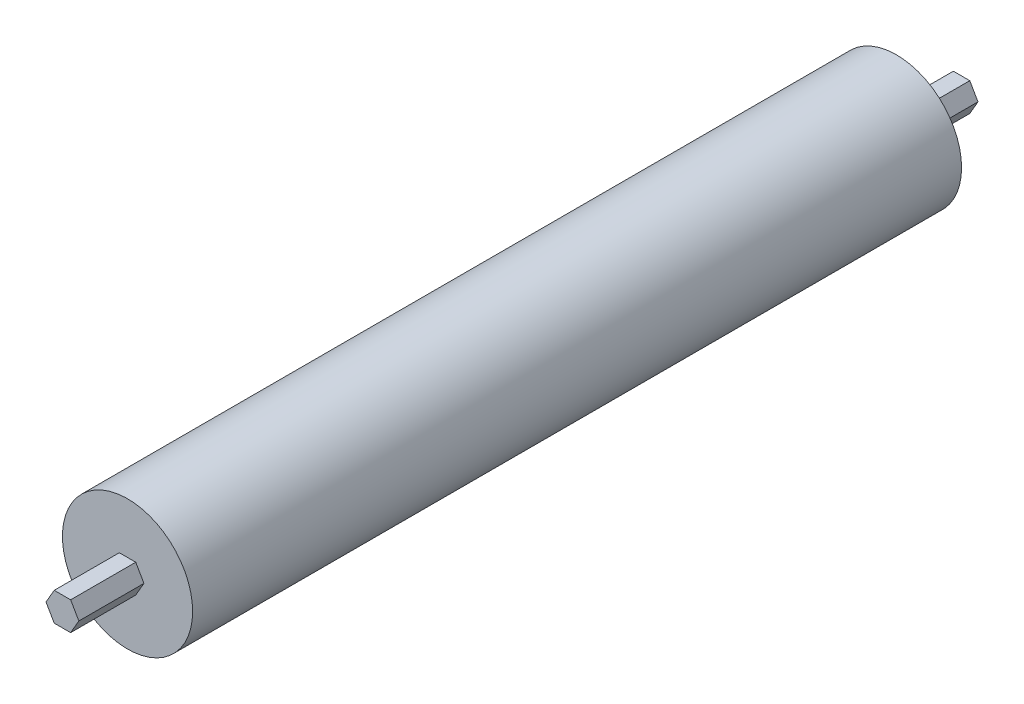
ISO-10303-21;
HEADER;
FILE_DESCRIPTION(('STEP AP214'),'2;1');
FILE_NAME('part.step','',(''),(''),'','','');
FILE_SCHEMA(('AUTOMOTIVE_DESIGN { 1 0 10303 214 1 1 1 1 }'));
ENDSEC;
DATA;
#1=APPLICATION_CONTEXT('core data for automotive mechanical design processes');
#2=APPLICATION_PROTOCOL_DEFINITION('international standard','automotive_design',2000,#1);
#3=PRODUCT_CONTEXT('',#1,'mechanical');
#4=PRODUCT('Part','Part','',(#3));
#5=PRODUCT_RELATED_PRODUCT_CATEGORY('part','',(#4));
#6=PRODUCT_DEFINITION_FORMATION('','',#4);
#7=PRODUCT_DEFINITION_CONTEXT('part definition',#1,'design');
#8=PRODUCT_DEFINITION('design','',#6,#7);
#9=PRODUCT_DEFINITION_SHAPE('','',#8);
#10=(LENGTH_UNIT() NAMED_UNIT(*) SI_UNIT(.MILLI.,.METRE.));
#11=(NAMED_UNIT(*) PLANE_ANGLE_UNIT() SI_UNIT($,.RADIAN.));
#12=(NAMED_UNIT(*) SI_UNIT($,.STERADIAN.) SOLID_ANGLE_UNIT());
#13=UNCERTAINTY_MEASURE_WITH_UNIT(LENGTH_MEASURE(1.E-05),#10,'distance_accuracy_value','');
#14=(GEOMETRIC_REPRESENTATION_CONTEXT(3) GLOBAL_UNCERTAINTY_ASSIGNED_CONTEXT((#13)) GLOBAL_UNIT_ASSIGNED_CONTEXT((#10,
#11,#12)) REPRESENTATION_CONTEXT('',''));
#15=CARTESIAN_POINT('',(0.,0.,0.));
#16=DIRECTION('',(0.,0.,1.));
#17=DIRECTION('',(1.,0.,0.));
#18=AXIS2_PLACEMENT_3D('',#15,#16,#17);
#19=CARTESIAN_POINT('',(0.,0.,0.));
#20=DIRECTION('',(0.,0.,1.));
#21=DIRECTION('',(1.,0.,0.));
#22=AXIS2_PLACEMENT_3D('',#19,#20,#21);
#23=PLANE('',#22);
#24=CARTESIAN_POINT('',(0.,0.,0.));
#25=DIRECTION('',(0.,0.,1.));
#26=DIRECTION('',(1.,0.,0.));
#27=AXIS2_PLACEMENT_3D('',#24,#25,#26);
#28=CIRCLE('',#27,25.4);
#29=CARTESIAN_POINT('',(25.4,0.,0.));
#30=VERTEX_POINT('',#29);
#31=EDGE_CURVE('E34',#30,#30,#28,.T.);
#32=ORIENTED_EDGE('',*,*,#31,.F.);
#33=EDGE_LOOP('',(#32));
#34=FACE_BOUND('',#33,.T.);
#35=DIRECTION('',(-0.5,0.866025403784439,0.));
#36=VECTOR('',#35,1.);
#37=CARTESIAN_POINT('',(-3.20429399400242,-5.55,0.));
#38=LINE('',#37,#36);
#39=CARTESIAN_POINT('',(-3.20429399400242,-5.55,0.));
#40=VERTEX_POINT('',#39);
#41=CARTESIAN_POINT('',(-6.40858798800484,0.,0.));
#42=VERTEX_POINT('',#41);
#43=EDGE_CURVE('E139',#40,#42,#38,.T.);
#44=ORIENTED_EDGE('',*,*,#43,.F.);
#45=DIRECTION('',(-1.,0.,0.));
#46=VECTOR('',#45,1.);
#47=CARTESIAN_POINT('',(3.20429399400243,-5.55,0.));
#48=LINE('',#47,#46);
#49=CARTESIAN_POINT('',(3.20429399400243,-5.55,0.));
#50=VERTEX_POINT('',#49);
#51=EDGE_CURVE('E136',#50,#40,#48,.T.);
#52=ORIENTED_EDGE('',*,*,#51,.F.);
#53=DIRECTION('',(-0.5,-0.866025403784439,0.));
#54=VECTOR('',#53,1.);
#55=CARTESIAN_POINT('',(6.40858798800485,0.,0.));
#56=LINE('',#55,#54);
#57=CARTESIAN_POINT('',(6.40858798800485,0.,0.));
#58=VERTEX_POINT('',#57);
#59=EDGE_CURVE('E204',#58,#50,#56,.T.);
#60=ORIENTED_EDGE('',*,*,#59,.F.);
#61=DIRECTION('',(0.5,-0.866025403784439,0.));
#62=VECTOR('',#61,1.);
#63=CARTESIAN_POINT('',(3.20429399400243,5.55,0.));
#64=LINE('',#63,#62);
#65=CARTESIAN_POINT('',(3.20429399400242,5.55,0.));
#66=VERTEX_POINT('',#65);
#67=EDGE_CURVE('E221',#66,#58,#64,.T.);
#68=ORIENTED_EDGE('',*,*,#67,.F.);
#69=DIRECTION('',(1.,0.,0.));
#70=VECTOR('',#69,1.);
#71=CARTESIAN_POINT('',(-3.20429399400242,5.55,0.));
#72=LINE('',#71,#70);
#73=CARTESIAN_POINT('',(-3.20429399400242,5.55,0.));
#74=VERTEX_POINT('',#73);
#75=EDGE_CURVE('E50',#74,#66,#72,.T.);
#76=ORIENTED_EDGE('',*,*,#75,.F.);
#77=DIRECTION('',(0.5,0.866025403784439,0.));
#78=VECTOR('',#77,1.);
#79=CARTESIAN_POINT('',(-6.40858798800485,0.,0.));
#80=LINE('',#79,#78);
#81=EDGE_CURVE('E45',#42,#74,#80,.T.);
#82=ORIENTED_EDGE('',*,*,#81,.F.);
#83=EDGE_LOOP('',(#44,#52,#60,#68,#76,#82));
#84=FACE_BOUND('',#83,.T.);
#85=ADVANCED_FACE('F30',(#34,#84),#23,.F.);
#86=CARTESIAN_POINT('',(0.,0.,300.));
#87=DIRECTION('',(0.,0.,1.));
#88=DIRECTION('',(1.,0.,0.));
#89=AXIS2_PLACEMENT_3D('',#86,#87,#88);
#90=PLANE('',#89);
#91=CARTESIAN_POINT('',(0.,0.,300.));
#92=DIRECTION('',(0.,0.,1.));
#93=DIRECTION('',(1.,0.,0.));
#94=AXIS2_PLACEMENT_3D('',#91,#92,#93);
#95=CIRCLE('',#94,25.4);
#96=CARTESIAN_POINT('',(25.4,0.,300.));
#97=VERTEX_POINT('',#96);
#98=EDGE_CURVE('E11',#97,#97,#95,.T.);
#99=ORIENTED_EDGE('',*,*,#98,.T.);
#100=EDGE_LOOP('',(#99));
#101=FACE_BOUND('',#100,.T.);
#102=DIRECTION('',(-0.5,0.866025403784439,0.));
#103=VECTOR('',#102,1.);
#104=CARTESIAN_POINT('',(6.40858798800484,0.,300.));
#105=LINE('',#104,#103);
#106=CARTESIAN_POINT('',(6.40858798800484,0.,300.));
#107=VERTEX_POINT('',#106);
#108=CARTESIAN_POINT('',(3.20429399400242,5.55,300.));
#109=VERTEX_POINT('',#108);
#110=EDGE_CURVE('E143',#107,#109,#105,.T.);
#111=ORIENTED_EDGE('',*,*,#110,.F.);
#112=DIRECTION('',(0.5,0.866025403784439,0.));
#113=VECTOR('',#112,1.);
#114=CARTESIAN_POINT('',(3.20429399400242,-5.55,300.));
#115=LINE('',#114,#113);
#116=CARTESIAN_POINT('',(3.20429399400242,-5.55,300.));
#117=VERTEX_POINT('',#116);
#118=EDGE_CURVE('E140',#117,#107,#115,.T.);
#119=ORIENTED_EDGE('',*,*,#118,.F.);
#120=DIRECTION('',(1.,0.,0.));
#121=VECTOR('',#120,1.);
#122=CARTESIAN_POINT('',(-3.20429399400242,-5.55,300.));
#123=LINE('',#122,#121);
#124=CARTESIAN_POINT('',(-3.20429399400242,-5.55,300.));
#125=VERTEX_POINT('',#124);
#126=EDGE_CURVE('E153',#125,#117,#123,.T.);
#127=ORIENTED_EDGE('',*,*,#126,.F.);
#128=DIRECTION('',(0.5,-0.866025403784439,0.));
#129=VECTOR('',#128,1.);
#130=CARTESIAN_POINT('',(-6.40858798800485,0.,300.));
#131=LINE('',#130,#129);
#132=CARTESIAN_POINT('',(-6.40858798800485,0.,300.));
#133=VERTEX_POINT('',#132);
#134=EDGE_CURVE('E169',#133,#125,#131,.T.);
#135=ORIENTED_EDGE('',*,*,#134,.F.);
#136=DIRECTION('',(-0.5,-0.866025403784439,0.));
#137=VECTOR('',#136,1.);
#138=CARTESIAN_POINT('',(-3.20429399400242,5.55,300.));
#139=LINE('',#138,#137);
#140=CARTESIAN_POINT('',(-3.20429399400242,5.55,300.));
#141=VERTEX_POINT('',#140);
#142=EDGE_CURVE('E167',#141,#133,#139,.T.);
#143=ORIENTED_EDGE('',*,*,#142,.F.);
#144=DIRECTION('',(-1.,0.,0.));
#145=VECTOR('',#144,1.);
#146=CARTESIAN_POINT('',(3.20429399400242,5.55,300.));
#147=LINE('',#146,#145);
#148=EDGE_CURVE('E165',#109,#141,#147,.T.);
#149=ORIENTED_EDGE('',*,*,#148,.F.);
#150=EDGE_LOOP('',(#111,#119,#127,#135,#143,#149));
#151=FACE_BOUND('',#150,.T.);
#152=ADVANCED_FACE('F194',(#101,#151),#90,.T.);
#153=CARTESIAN_POINT('',(0.,0.,300.));
#154=DIRECTION('',(0.,0.,-1.));
#155=DIRECTION('',(-1.,0.,0.));
#156=AXIS2_PLACEMENT_3D('',#153,#154,#155);
#157=CYLINDRICAL_SURFACE('',#156,25.4);
#158=ORIENTED_EDGE('',*,*,#98,.F.);
#159=EDGE_LOOP('',(#158));
#160=FACE_BOUND('',#159,.T.);
#161=ORIENTED_EDGE('',*,*,#31,.T.);
#162=EDGE_LOOP('',(#161));
#163=FACE_BOUND('',#162,.T.);
#164=ADVANCED_FACE('F32',(#160,#163),#157,.T.);
#165=CARTESIAN_POINT('',(3.20429399400242,-5.55,325.4));
#166=DIRECTION('',(-0.866025403784439,0.5,0.));
#167=DIRECTION('',(-0.5,-0.866025403784439,0.));
#168=AXIS2_PLACEMENT_3D('',#165,#166,#167);
#169=PLANE('',#168);
#170=ORIENTED_EDGE('',*,*,#118,.T.);
#171=DIRECTION('',(0.,0.,-1.));
#172=VECTOR('',#171,1.);
#173=CARTESIAN_POINT('',(6.40858798800484,0.,325.4));
#174=LINE('',#173,#172);
#175=CARTESIAN_POINT('',(6.40858798800484,0.,325.4));
#176=VERTEX_POINT('',#175);
#177=EDGE_CURVE('E186',#176,#107,#174,.T.);
#178=ORIENTED_EDGE('',*,*,#177,.F.);
#179=DIRECTION('',(0.5,0.866025403784439,0.));
#180=VECTOR('',#179,1.);
#181=CARTESIAN_POINT('',(3.20429399400242,-5.55,325.4));
#182=LINE('',#181,#180);
#183=CARTESIAN_POINT('',(3.20429399400242,-5.55,325.4));
#184=VERTEX_POINT('',#183);
#185=EDGE_CURVE('E149',#184,#176,#182,.T.);
#186=ORIENTED_EDGE('',*,*,#185,.F.);
#187=DIRECTION('',(0.,0.,-1.));
#188=VECTOR('',#187,1.);
#189=CARTESIAN_POINT('',(3.20429399400242,-5.55,325.4));
#190=LINE('',#189,#188);
#191=EDGE_CURVE('E162',#184,#117,#190,.T.);
#192=ORIENTED_EDGE('',*,*,#191,.T.);
#193=EDGE_LOOP('',(#170,#178,#186,#192));
#194=FACE_BOUND('',#193,.T.);
#195=ADVANCED_FACE('F273',(#194),#169,.F.);
#196=CARTESIAN_POINT('',(6.40858798800484,0.,325.4));
#197=DIRECTION('',(-0.866025403784439,-0.5,0.));
#198=DIRECTION('',(0.5,-0.866025403784439,0.));
#199=AXIS2_PLACEMENT_3D('',#196,#197,#198);
#200=PLANE('',#199);
#201=ORIENTED_EDGE('',*,*,#110,.T.);
#202=DIRECTION('',(0.,0.,-1.));
#203=VECTOR('',#202,1.);
#204=CARTESIAN_POINT('',(3.20429399400242,5.55,325.4));
#205=LINE('',#204,#203);
#206=CARTESIAN_POINT('',(3.20429399400242,5.55,325.4));
#207=VERTEX_POINT('',#206);
#208=EDGE_CURVE('E183',#207,#109,#205,.T.);
#209=ORIENTED_EDGE('',*,*,#208,.F.);
#210=DIRECTION('',(-0.5,0.866025403784439,0.));
#211=VECTOR('',#210,1.);
#212=CARTESIAN_POINT('',(6.40858798800484,0.,325.4));
#213=LINE('',#212,#211);
#214=EDGE_CURVE('E152',#176,#207,#213,.T.);
#215=ORIENTED_EDGE('',*,*,#214,.F.);
#216=ORIENTED_EDGE('',*,*,#177,.T.);
#217=EDGE_LOOP('',(#201,#209,#215,#216));
#218=FACE_BOUND('',#217,.T.);
#219=ADVANCED_FACE('F269',(#218),#200,.F.);
#220=CARTESIAN_POINT('',(3.20429399400242,5.55,325.4));
#221=DIRECTION('',(0.,-1.,0.));
#222=DIRECTION('',(0.,0.,-1.));
#223=AXIS2_PLACEMENT_3D('',#220,#221,#222);
#224=PLANE('',#223);
#225=ORIENTED_EDGE('',*,*,#148,.T.);
#226=DIRECTION('',(0.,0.,-1.));
#227=VECTOR('',#226,1.);
#228=CARTESIAN_POINT('',(-3.20429399400242,5.55,325.4));
#229=LINE('',#228,#227);
#230=CARTESIAN_POINT('',(-3.20429399400242,5.55,325.4));
#231=VERTEX_POINT('',#230);
#232=EDGE_CURVE('E180',#231,#141,#229,.T.);
#233=ORIENTED_EDGE('',*,*,#232,.F.);
#234=DIRECTION('',(-1.,0.,0.));
#235=VECTOR('',#234,1.);
#236=CARTESIAN_POINT('',(3.20429399400242,5.55,325.4));
#237=LINE('',#236,#235);
#238=EDGE_CURVE('E155',#207,#231,#237,.T.);
#239=ORIENTED_EDGE('',*,*,#238,.F.);
#240=ORIENTED_EDGE('',*,*,#208,.T.);
#241=EDGE_LOOP('',(#225,#233,#239,#240));
#242=FACE_BOUND('',#241,.T.);
#243=ADVANCED_FACE('F265',(#242),#224,.F.);
#244=CARTESIAN_POINT('',(-3.20429399400242,5.55,325.4));
#245=DIRECTION('',(0.866025403784439,-0.5,0.));
#246=DIRECTION('',(0.5,0.866025403784439,0.));
#247=AXIS2_PLACEMENT_3D('',#244,#245,#246);
#248=PLANE('',#247);
#249=ORIENTED_EDGE('',*,*,#142,.T.);
#250=DIRECTION('',(0.,0.,-1.));
#251=VECTOR('',#250,1.);
#252=CARTESIAN_POINT('',(-6.40858798800485,0.,325.4));
#253=LINE('',#252,#251);
#254=CARTESIAN_POINT('',(-6.40858798800485,0.,325.4));
#255=VERTEX_POINT('',#254);
#256=EDGE_CURVE('E177',#255,#133,#253,.T.);
#257=ORIENTED_EDGE('',*,*,#256,.F.);
#258=DIRECTION('',(-0.5,-0.866025403784439,0.));
#259=VECTOR('',#258,1.);
#260=CARTESIAN_POINT('',(-3.20429399400242,5.55,325.4));
#261=LINE('',#260,#259);
#262=EDGE_CURVE('E157',#231,#255,#261,.T.);
#263=ORIENTED_EDGE('',*,*,#262,.F.);
#264=ORIENTED_EDGE('',*,*,#232,.T.);
#265=EDGE_LOOP('',(#249,#257,#263,#264));
#266=FACE_BOUND('',#265,.T.);
#267=ADVANCED_FACE('F261',(#266),#248,.F.);
#268=CARTESIAN_POINT('',(-6.40858798800485,0.,325.4));
#269=DIRECTION('',(0.866025403784439,0.5,0.));
#270=DIRECTION('',(-0.5,0.866025403784439,0.));
#271=AXIS2_PLACEMENT_3D('',#268,#269,#270);
#272=PLANE('',#271);
#273=ORIENTED_EDGE('',*,*,#134,.T.);
#274=DIRECTION('',(0.,0.,-1.));
#275=VECTOR('',#274,1.);
#276=CARTESIAN_POINT('',(-3.20429399400242,-5.55,325.4));
#277=LINE('',#276,#275);
#278=CARTESIAN_POINT('',(-3.20429399400242,-5.55,325.4));
#279=VERTEX_POINT('',#278);
#280=EDGE_CURVE('E175',#279,#125,#277,.T.);
#281=ORIENTED_EDGE('',*,*,#280,.F.);
#282=DIRECTION('',(0.5,-0.866025403784439,0.));
#283=VECTOR('',#282,1.);
#284=CARTESIAN_POINT('',(-6.40858798800485,0.,325.4));
#285=LINE('',#284,#283);
#286=EDGE_CURVE('E159',#255,#279,#285,.T.);
#287=ORIENTED_EDGE('',*,*,#286,.F.);
#288=ORIENTED_EDGE('',*,*,#256,.T.);
#289=EDGE_LOOP('',(#273,#281,#287,#288));
#290=FACE_BOUND('',#289,.T.);
#291=ADVANCED_FACE('F257',(#290),#272,.F.);
#292=CARTESIAN_POINT('',(-3.20429399400242,-5.55,325.4));
#293=DIRECTION('',(0.,1.,0.));
#294=DIRECTION('',(-1.,0.,0.));
#295=AXIS2_PLACEMENT_3D('',#292,#293,#294);
#296=PLANE('',#295);
#297=ORIENTED_EDGE('',*,*,#126,.T.);
#298=ORIENTED_EDGE('',*,*,#191,.F.);
#299=DIRECTION('',(1.,0.,0.));
#300=VECTOR('',#299,1.);
#301=CARTESIAN_POINT('',(-3.20429399400242,-5.55,325.4));
#302=LINE('',#301,#300);
#303=EDGE_CURVE('E161',#279,#184,#302,.T.);
#304=ORIENTED_EDGE('',*,*,#303,.F.);
#305=ORIENTED_EDGE('',*,*,#280,.T.);
#306=EDGE_LOOP('',(#297,#298,#304,#305));
#307=FACE_BOUND('',#306,.T.);
#308=ADVANCED_FACE('F253',(#307),#296,.F.);
#309=CARTESIAN_POINT('',(6.40858798800484,0.,325.4));
#310=DIRECTION('',(0.,0.,1.));
#311=DIRECTION('',(1.,0.,0.));
#312=AXIS2_PLACEMENT_3D('',#309,#310,#311);
#313=PLANE('',#312);
#314=ORIENTED_EDGE('',*,*,#185,.T.);
#315=ORIENTED_EDGE('',*,*,#214,.T.);
#316=ORIENTED_EDGE('',*,*,#238,.T.);
#317=ORIENTED_EDGE('',*,*,#262,.T.);
#318=ORIENTED_EDGE('',*,*,#286,.T.);
#319=ORIENTED_EDGE('',*,*,#303,.T.);
#320=EDGE_LOOP('',(#314,#315,#316,#317,#318,#319));
#321=FACE_BOUND('',#320,.T.);
#322=ADVANCED_FACE('F250',(#321),#313,.T.);
#323=CARTESIAN_POINT('',(-3.20429399400242,-5.55,-25.4));
#324=DIRECTION('',(0.866025403784439,0.5,0.));
#325=DIRECTION('',(-0.5,0.866025403784439,0.));
#326=AXIS2_PLACEMENT_3D('',#323,#324,#325);
#327=PLANE('',#326);
#328=ORIENTED_EDGE('',*,*,#43,.T.);
#329=DIRECTION('',(0.,0.,1.));
#330=VECTOR('',#329,1.);
#331=CARTESIAN_POINT('',(-6.40858798800485,0.,-25.4));
#332=LINE('',#331,#330);
#333=CARTESIAN_POINT('',(-6.40858798800485,0.,-25.4));
#334=VERTEX_POINT('',#333);
#335=EDGE_CURVE('E120',#334,#42,#332,.T.);
#336=ORIENTED_EDGE('',*,*,#335,.F.);
#337=DIRECTION('',(-0.5,0.866025403784439,0.));
#338=VECTOR('',#337,1.);
#339=CARTESIAN_POINT('',(-3.20429399400242,-5.55,-25.4));
#340=LINE('',#339,#338);
#341=CARTESIAN_POINT('',(-3.20429399400242,-5.55,-25.4));
#342=VERTEX_POINT('',#341);
#343=EDGE_CURVE('E127',#342,#334,#340,.T.);
#344=ORIENTED_EDGE('',*,*,#343,.F.);
#345=DIRECTION('',(0.,0.,1.));
#346=VECTOR('',#345,1.);
#347=CARTESIAN_POINT('',(-3.20429399400242,-5.55,-25.4));
#348=LINE('',#347,#346);
#349=EDGE_CURVE('E201',#342,#40,#348,.T.);
#350=ORIENTED_EDGE('',*,*,#349,.T.);
#351=EDGE_LOOP('',(#328,#336,#344,#350));
#352=FACE_BOUND('',#351,.T.);
#353=ADVANCED_FACE('F138',(#352),#327,.F.);
#354=CARTESIAN_POINT('',(-6.40858798800485,0.,-25.4));
#355=DIRECTION('',(0.866025403784439,-0.5,0.));
#356=DIRECTION('',(0.5,0.866025403784439,0.));
#357=AXIS2_PLACEMENT_3D('',#354,#355,#356);
#358=PLANE('',#357);
#359=ORIENTED_EDGE('',*,*,#81,.T.);
#360=DIRECTION('',(0.,0.,1.));
#361=VECTOR('',#360,1.);
#362=CARTESIAN_POINT('',(-3.20429399400242,5.55,-25.4));
#363=LINE('',#362,#361);
#364=CARTESIAN_POINT('',(-3.20429399400242,5.55,-25.4));
#365=VERTEX_POINT('',#364);
#366=EDGE_CURVE('E123',#365,#74,#363,.T.);
#367=ORIENTED_EDGE('',*,*,#366,.F.);
#368=DIRECTION('',(0.5,0.866025403784439,0.));
#369=VECTOR('',#368,1.);
#370=CARTESIAN_POINT('',(-6.40858798800485,0.,-25.4));
#371=LINE('',#370,#369);
#372=EDGE_CURVE('E116',#334,#365,#371,.T.);
#373=ORIENTED_EDGE('',*,*,#372,.F.);
#374=ORIENTED_EDGE('',*,*,#335,.T.);
#375=EDGE_LOOP('',(#359,#367,#373,#374));
#376=FACE_BOUND('',#375,.T.);
#377=ADVANCED_FACE('F118',(#376),#358,.F.);
#378=CARTESIAN_POINT('',(-3.20429399400242,5.55,-25.4));
#379=DIRECTION('',(0.,-1.,0.));
#380=DIRECTION('',(0.,0.,-1.));
#381=AXIS2_PLACEMENT_3D('',#378,#379,#380);
#382=PLANE('',#381);
#383=ORIENTED_EDGE('',*,*,#75,.T.);
#384=DIRECTION('',(0.,0.,1.));
#385=VECTOR('',#384,1.);
#386=CARTESIAN_POINT('',(3.20429399400243,5.55,-25.4));
#387=LINE('',#386,#385);
#388=CARTESIAN_POINT('',(3.20429399400243,5.55,-25.4));
#389=VERTEX_POINT('',#388);
#390=EDGE_CURVE('E145',#389,#66,#387,.T.);
#391=ORIENTED_EDGE('',*,*,#390,.F.);
#392=DIRECTION('',(1.,0.,0.));
#393=VECTOR('',#392,1.);
#394=CARTESIAN_POINT('',(-3.20429399400242,5.55,-25.4));
#395=LINE('',#394,#393);
#396=EDGE_CURVE('E126',#365,#389,#395,.T.);
#397=ORIENTED_EDGE('',*,*,#396,.F.);
#398=ORIENTED_EDGE('',*,*,#366,.T.);
#399=EDGE_LOOP('',(#383,#391,#397,#398));
#400=FACE_BOUND('',#399,.T.);
#401=ADVANCED_FACE('F224',(#400),#382,.F.);
#402=CARTESIAN_POINT('',(3.20429399400243,5.55,-25.4));
#403=DIRECTION('',(-0.866025403784439,-0.5,0.));
#404=DIRECTION('',(0.5,-0.866025403784439,0.));
#405=AXIS2_PLACEMENT_3D('',#402,#403,#404);
#406=PLANE('',#405);
#407=ORIENTED_EDGE('',*,*,#67,.T.);
#408=DIRECTION('',(0.,0.,1.));
#409=VECTOR('',#408,1.);
#410=CARTESIAN_POINT('',(6.40858798800485,0.,-25.4));
#411=LINE('',#410,#409);
#412=CARTESIAN_POINT('',(6.40858798800485,0.,-25.4));
#413=VERTEX_POINT('',#412);
#414=EDGE_CURVE('E207',#413,#58,#411,.T.);
#415=ORIENTED_EDGE('',*,*,#414,.F.);
#416=DIRECTION('',(0.5,-0.866025403784439,0.));
#417=VECTOR('',#416,1.);
#418=CARTESIAN_POINT('',(3.20429399400243,5.55,-25.4));
#419=LINE('',#418,#417);
#420=EDGE_CURVE('E222',#389,#413,#419,.T.);
#421=ORIENTED_EDGE('',*,*,#420,.F.);
#422=ORIENTED_EDGE('',*,*,#390,.T.);
#423=EDGE_LOOP('',(#407,#415,#421,#422));
#424=FACE_BOUND('',#423,.T.);
#425=ADVANCED_FACE('F219',(#424),#406,.F.);
#426=CARTESIAN_POINT('',(6.40858798800485,0.,-25.4));
#427=DIRECTION('',(-0.866025403784439,0.5,0.));
#428=DIRECTION('',(-0.5,-0.866025403784439,0.));
#429=AXIS2_PLACEMENT_3D('',#426,#427,#428);
#430=PLANE('',#429);
#431=ORIENTED_EDGE('',*,*,#59,.T.);
#432=DIRECTION('',(0.,0.,1.));
#433=VECTOR('',#432,1.);
#434=CARTESIAN_POINT('',(3.20429399400243,-5.55,-25.4));
#435=LINE('',#434,#433);
#436=CARTESIAN_POINT('',(3.20429399400243,-5.55,-25.4));
#437=VERTEX_POINT('',#436);
#438=EDGE_CURVE('E203',#437,#50,#435,.T.);
#439=ORIENTED_EDGE('',*,*,#438,.F.);
#440=DIRECTION('',(-0.5,-0.866025403784439,0.));
#441=VECTOR('',#440,1.);
#442=CARTESIAN_POINT('',(6.40858798800485,0.,-25.4));
#443=LINE('',#442,#441);
#444=EDGE_CURVE('E209',#413,#437,#443,.T.);
#445=ORIENTED_EDGE('',*,*,#444,.F.);
#446=ORIENTED_EDGE('',*,*,#414,.T.);
#447=EDGE_LOOP('',(#431,#439,#445,#446));
#448=FACE_BOUND('',#447,.T.);
#449=ADVANCED_FACE('F229',(#448),#430,.F.);
#450=CARTESIAN_POINT('',(3.20429399400243,-5.55,-25.4));
#451=DIRECTION('',(0.,1.,0.));
#452=DIRECTION('',(-1.,0.,0.));
#453=AXIS2_PLACEMENT_3D('',#450,#451,#452);
#454=PLANE('',#453);
#455=ORIENTED_EDGE('',*,*,#51,.T.);
#456=ORIENTED_EDGE('',*,*,#349,.F.);
#457=DIRECTION('',(-1.,0.,0.));
#458=VECTOR('',#457,1.);
#459=CARTESIAN_POINT('',(3.20429399400243,-5.55,-25.4));
#460=LINE('',#459,#458);
#461=EDGE_CURVE('E132',#437,#342,#460,.T.);
#462=ORIENTED_EDGE('',*,*,#461,.F.);
#463=ORIENTED_EDGE('',*,*,#438,.T.);
#464=EDGE_LOOP('',(#455,#456,#462,#463));
#465=FACE_BOUND('',#464,.T.);
#466=ADVANCED_FACE('F200',(#465),#454,.F.);
#467=CARTESIAN_POINT('',(-6.40858798800485,0.,-25.4));
#468=DIRECTION('',(0.,0.,-1.));
#469=DIRECTION('',(-1.,0.,0.));
#470=AXIS2_PLACEMENT_3D('',#467,#468,#469);
#471=PLANE('',#470);
#472=ORIENTED_EDGE('',*,*,#343,.T.);
#473=ORIENTED_EDGE('',*,*,#372,.T.);
#474=ORIENTED_EDGE('',*,*,#396,.T.);
#475=ORIENTED_EDGE('',*,*,#420,.T.);
#476=ORIENTED_EDGE('',*,*,#444,.T.);
#477=ORIENTED_EDGE('',*,*,#461,.T.);
#478=EDGE_LOOP('',(#472,#473,#474,#475,#476,#477));
#479=FACE_BOUND('',#478,.T.);
#480=ADVANCED_FACE('F130',(#479),#471,.T.);
#481=CLOSED_SHELL('',(#85,#152,#164,#195,#219,#243,#267,#291,#308,#322,#353,#377,#401,#425,#449,
#466,#480));
#482=MANIFOLD_SOLID_BREP('B2',#481);
#483=ADVANCED_BREP_SHAPE_REPRESENTATION('',(#18,#482),#14);
#484=SHAPE_DEFINITION_REPRESENTATION(#9,#483);
ENDSEC;
END-ISO-10303-21;
